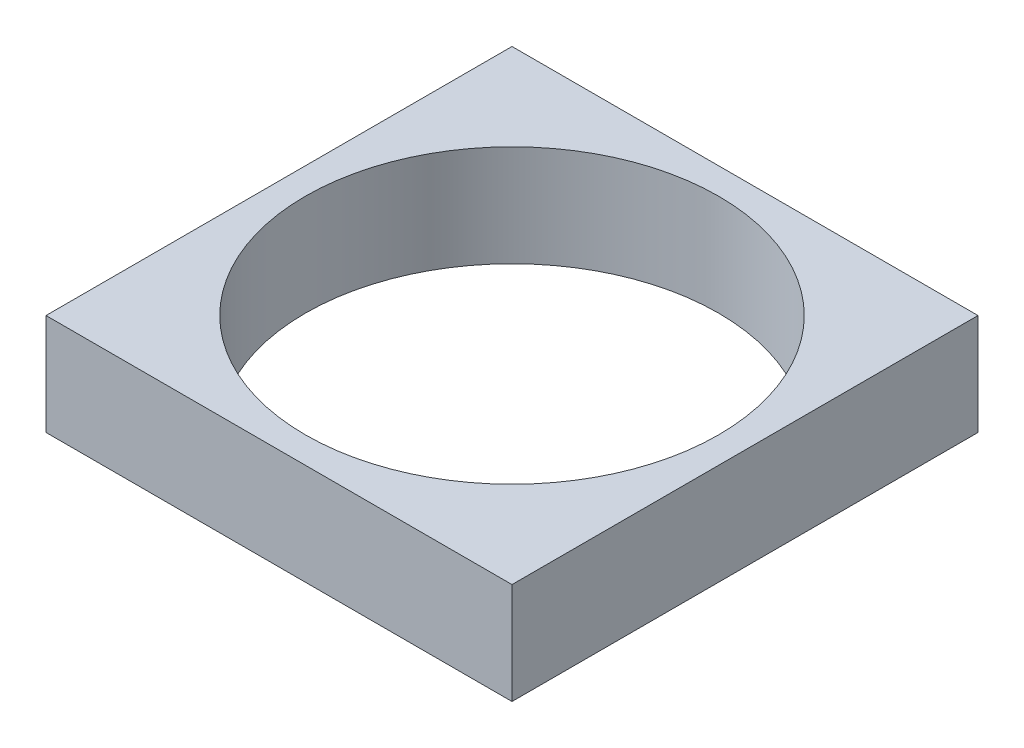
ISO-10303-21;
HEADER;
FILE_DESCRIPTION(('STEP AP214'),'2;1');
FILE_NAME('part.step','',(''),(''),'','','');
FILE_SCHEMA(('AUTOMOTIVE_DESIGN { 1 0 10303 214 1 1 1 1 }'));
ENDSEC;
DATA;
#1=APPLICATION_CONTEXT('core data for automotive mechanical design processes');
#2=APPLICATION_PROTOCOL_DEFINITION('international standard','automotive_design',2000,#1);
#3=PRODUCT_CONTEXT('',#1,'mechanical');
#4=PRODUCT('Part','Part','',(#3));
#5=PRODUCT_RELATED_PRODUCT_CATEGORY('part','',(#4));
#6=PRODUCT_DEFINITION_FORMATION('','',#4);
#7=PRODUCT_DEFINITION_CONTEXT('part definition',#1,'design');
#8=PRODUCT_DEFINITION('design','',#6,#7);
#9=PRODUCT_DEFINITION_SHAPE('','',#8);
#10=(LENGTH_UNIT() NAMED_UNIT(*) SI_UNIT(.MILLI.,.METRE.));
#11=(NAMED_UNIT(*) PLANE_ANGLE_UNIT() SI_UNIT($,.RADIAN.));
#12=(NAMED_UNIT(*) SI_UNIT($,.STERADIAN.) SOLID_ANGLE_UNIT());
#13=UNCERTAINTY_MEASURE_WITH_UNIT(LENGTH_MEASURE(1.E-05),#10,'distance_accuracy_value','');
#14=(GEOMETRIC_REPRESENTATION_CONTEXT(3) GLOBAL_UNCERTAINTY_ASSIGNED_CONTEXT((#13)) GLOBAL_UNIT_ASSIGNED_CONTEXT((#10,
#11,#12)) REPRESENTATION_CONTEXT('',''));
#15=CARTESIAN_POINT('',(0.,0.,0.));
#16=DIRECTION('',(0.,0.,1.));
#17=DIRECTION('',(1.,0.,0.));
#18=AXIS2_PLACEMENT_3D('',#15,#16,#17);
#19=CARTESIAN_POINT('',(0.,2.5,0.));
#20=DIRECTION('',(0.,-1.,0.));
#21=DIRECTION('',(0.,0.,-1.));
#22=AXIS2_PLACEMENT_3D('',#19,#20,#21);
#23=PLANE('',#22);
#24=DIRECTION('',(0.,0.,-1.));
#25=VECTOR('',#24,1.);
#26=CARTESIAN_POINT('',(11.5,2.5,11.5));
#27=LINE('',#26,#25);
#28=CARTESIAN_POINT('',(11.5,2.5,11.5));
#29=VERTEX_POINT('',#28);
#30=CARTESIAN_POINT('',(11.5,2.5,-11.5));
#31=VERTEX_POINT('',#30);
#32=EDGE_CURVE('E88',#29,#31,#27,.T.);
#33=ORIENTED_EDGE('',*,*,#32,.T.);
#34=DIRECTION('',(-1.,0.,0.));
#35=VECTOR('',#34,1.);
#36=CARTESIAN_POINT('',(-11.5,2.5,-11.5));
#37=LINE('',#36,#35);
#38=CARTESIAN_POINT('',(-11.5,2.5,-11.5));
#39=VERTEX_POINT('',#38);
#40=EDGE_CURVE('E83',#31,#39,#37,.T.);
#41=ORIENTED_EDGE('',*,*,#40,.T.);
#42=DIRECTION('',(0.,0.,1.));
#43=VECTOR('',#42,1.);
#44=CARTESIAN_POINT('',(-11.5,2.5,11.5));
#45=LINE('',#44,#43);
#46=CARTESIAN_POINT('',(-11.5,2.5,11.5));
#47=VERTEX_POINT('',#46);
#48=EDGE_CURVE('E86',#39,#47,#45,.T.);
#49=ORIENTED_EDGE('',*,*,#48,.T.);
#50=DIRECTION('',(1.,0.,0.));
#51=VECTOR('',#50,1.);
#52=CARTESIAN_POINT('',(-11.5,2.5,11.5));
#53=LINE('',#52,#51);
#54=EDGE_CURVE('E53',#47,#29,#53,.T.);
#55=ORIENTED_EDGE('',*,*,#54,.T.);
#56=EDGE_LOOP('',(#33,#41,#49,#55));
#57=FACE_BOUND('',#56,.T.);
#58=CARTESIAN_POINT('',(0.,2.5,0.));
#59=DIRECTION('',(0.,1.,0.));
#60=DIRECTION('',(0.,0.,1.));
#61=AXIS2_PLACEMENT_3D('',#58,#59,#60);
#62=CIRCLE('',#61,10.2);
#63=CARTESIAN_POINT('',(0.,2.5,10.2));
#64=VERTEX_POINT('',#63);
#65=EDGE_CURVE('E103',#64,#64,#62,.T.);
#66=ORIENTED_EDGE('',*,*,#65,.F.);
#67=EDGE_LOOP('',(#66));
#68=FACE_BOUND('',#67,.T.);
#69=ADVANCED_FACE('F36',(#57,#68),#23,.F.);
#70=CARTESIAN_POINT('',(0.,-2.5,0.));
#71=DIRECTION('',(0.,-1.,0.));
#72=DIRECTION('',(0.,0.,-1.));
#73=AXIS2_PLACEMENT_3D('',#70,#71,#72);
#74=PLANE('',#73);
#75=DIRECTION('',(0.,0.,-1.));
#76=VECTOR('',#75,1.);
#77=CARTESIAN_POINT('',(11.5,-2.5,11.5));
#78=LINE('',#77,#76);
#79=CARTESIAN_POINT('',(11.5,-2.5,11.5));
#80=VERTEX_POINT('',#79);
#81=CARTESIAN_POINT('',(11.5,-2.5,-11.5));
#82=VERTEX_POINT('',#81);
#83=EDGE_CURVE('E100',#80,#82,#78,.T.);
#84=ORIENTED_EDGE('',*,*,#83,.F.);
#85=DIRECTION('',(1.,0.,0.));
#86=VECTOR('',#85,1.);
#87=CARTESIAN_POINT('',(-11.5,-2.5,11.5));
#88=LINE('',#87,#86);
#89=CARTESIAN_POINT('',(-11.5,-2.5,11.5));
#90=VERTEX_POINT('',#89);
#91=EDGE_CURVE('E76',#90,#80,#88,.T.);
#92=ORIENTED_EDGE('',*,*,#91,.F.);
#93=DIRECTION('',(0.,0.,1.));
#94=VECTOR('',#93,1.);
#95=CARTESIAN_POINT('',(-11.5,-2.5,11.5));
#96=LINE('',#95,#94);
#97=CARTESIAN_POINT('',(-11.5,-2.5,-11.5));
#98=VERTEX_POINT('',#97);
#99=EDGE_CURVE('E70',#98,#90,#96,.T.);
#100=ORIENTED_EDGE('',*,*,#99,.F.);
#101=DIRECTION('',(-1.,0.,0.));
#102=VECTOR('',#101,1.);
#103=CARTESIAN_POINT('',(-11.5,-2.5,-11.5));
#104=LINE('',#103,#102);
#105=EDGE_CURVE('E92',#82,#98,#104,.T.);
#106=ORIENTED_EDGE('',*,*,#105,.F.);
#107=EDGE_LOOP('',(#84,#92,#100,#106));
#108=FACE_BOUND('',#107,.T.);
#109=CARTESIAN_POINT('',(0.,-2.5,0.));
#110=DIRECTION('',(0.,1.,0.));
#111=DIRECTION('',(0.,0.,1.));
#112=AXIS2_PLACEMENT_3D('',#109,#110,#111);
#113=CIRCLE('',#112,10.2);
#114=CARTESIAN_POINT('',(0.,-2.5,10.2));
#115=VERTEX_POINT('',#114);
#116=EDGE_CURVE('E115',#115,#115,#113,.T.);
#117=ORIENTED_EDGE('',*,*,#116,.T.);
#118=EDGE_LOOP('',(#117));
#119=FACE_BOUND('',#118,.T.);
#120=ADVANCED_FACE('F111',(#108,#119),#74,.T.);
#121=CARTESIAN_POINT('',(11.5,2.5,11.5));
#122=DIRECTION('',(-1.,0.,0.));
#123=DIRECTION('',(0.,0.,1.));
#124=AXIS2_PLACEMENT_3D('',#121,#122,#123);
#125=PLANE('',#124);
#126=ORIENTED_EDGE('',*,*,#83,.T.);
#127=DIRECTION('',(0.,-1.,0.));
#128=VECTOR('',#127,1.);
#129=CARTESIAN_POINT('',(11.5,2.5,-11.5));
#130=LINE('',#129,#128);
#131=EDGE_CURVE('E11',#31,#82,#130,.T.);
#132=ORIENTED_EDGE('',*,*,#131,.F.);
#133=ORIENTED_EDGE('',*,*,#32,.F.);
#134=DIRECTION('',(0.,-1.,0.));
#135=VECTOR('',#134,1.);
#136=CARTESIAN_POINT('',(11.5,2.5,11.5));
#137=LINE('',#136,#135);
#138=EDGE_CURVE('E96',#29,#80,#137,.T.);
#139=ORIENTED_EDGE('',*,*,#138,.T.);
#140=EDGE_LOOP('',(#126,#132,#133,#139));
#141=FACE_BOUND('',#140,.T.);
#142=ADVANCED_FACE('F38',(#141),#125,.F.);
#143=CARTESIAN_POINT('',(-11.5,2.5,-11.5));
#144=DIRECTION('',(0.,0.,1.));
#145=DIRECTION('',(1.,0.,0.));
#146=AXIS2_PLACEMENT_3D('',#143,#144,#145);
#147=PLANE('',#146);
#148=ORIENTED_EDGE('',*,*,#105,.T.);
#149=DIRECTION('',(0.,-1.,0.));
#150=VECTOR('',#149,1.);
#151=CARTESIAN_POINT('',(-11.5,2.5,-11.5));
#152=LINE('',#151,#150);
#153=EDGE_CURVE('E45',#39,#98,#152,.T.);
#154=ORIENTED_EDGE('',*,*,#153,.F.);
#155=ORIENTED_EDGE('',*,*,#40,.F.);
#156=ORIENTED_EDGE('',*,*,#131,.T.);
#157=EDGE_LOOP('',(#148,#154,#155,#156));
#158=FACE_BOUND('',#157,.T.);
#159=ADVANCED_FACE('F91',(#158),#147,.F.);
#160=CARTESIAN_POINT('',(-11.5,2.5,11.5));
#161=DIRECTION('',(1.,0.,0.));
#162=DIRECTION('',(0.,0.,-1.));
#163=AXIS2_PLACEMENT_3D('',#160,#161,#162);
#164=PLANE('',#163);
#165=ORIENTED_EDGE('',*,*,#99,.T.);
#166=DIRECTION('',(0.,-1.,0.));
#167=VECTOR('',#166,1.);
#168=CARTESIAN_POINT('',(-11.5,2.5,11.5));
#169=LINE('',#168,#167);
#170=EDGE_CURVE('E93',#47,#90,#169,.T.);
#171=ORIENTED_EDGE('',*,*,#170,.F.);
#172=ORIENTED_EDGE('',*,*,#48,.F.);
#173=ORIENTED_EDGE('',*,*,#153,.T.);
#174=EDGE_LOOP('',(#165,#171,#172,#173));
#175=FACE_BOUND('',#174,.T.);
#176=ADVANCED_FACE('F94',(#175),#164,.F.);
#177=CARTESIAN_POINT('',(-11.5,2.5,11.5));
#178=DIRECTION('',(0.,0.,-1.));
#179=DIRECTION('',(-1.,0.,0.));
#180=AXIS2_PLACEMENT_3D('',#177,#178,#179);
#181=PLANE('',#180);
#182=ORIENTED_EDGE('',*,*,#91,.T.);
#183=ORIENTED_EDGE('',*,*,#138,.F.);
#184=ORIENTED_EDGE('',*,*,#54,.F.);
#185=ORIENTED_EDGE('',*,*,#170,.T.);
#186=EDGE_LOOP('',(#182,#183,#184,#185));
#187=FACE_BOUND('',#186,.T.);
#188=ADVANCED_FACE('F108',(#187),#181,.F.);
#189=CARTESIAN_POINT('',(0.,2.5,0.));
#190=DIRECTION('',(0.,-1.,0.));
#191=DIRECTION('',(0.,0.,-1.));
#192=AXIS2_PLACEMENT_3D('',#189,#190,#191);
#193=CYLINDRICAL_SURFACE('',#192,10.2);
#194=ORIENTED_EDGE('',*,*,#65,.T.);
#195=EDGE_LOOP('',(#194));
#196=FACE_BOUND('',#195,.T.);
#197=ORIENTED_EDGE('',*,*,#116,.F.);
#198=EDGE_LOOP('',(#197));
#199=FACE_BOUND('',#198,.T.);
#200=ADVANCED_FACE('F121',(#196,#199),#193,.F.);
#201=CLOSED_SHELL('',(#69,#120,#142,#159,#176,#188,#200));
#202=MANIFOLD_SOLID_BREP('B2',#201);
#203=ADVANCED_BREP_SHAPE_REPRESENTATION('',(#18,#202),#14);
#204=SHAPE_DEFINITION_REPRESENTATION(#9,#203);
ENDSEC;
END-ISO-10303-21;
